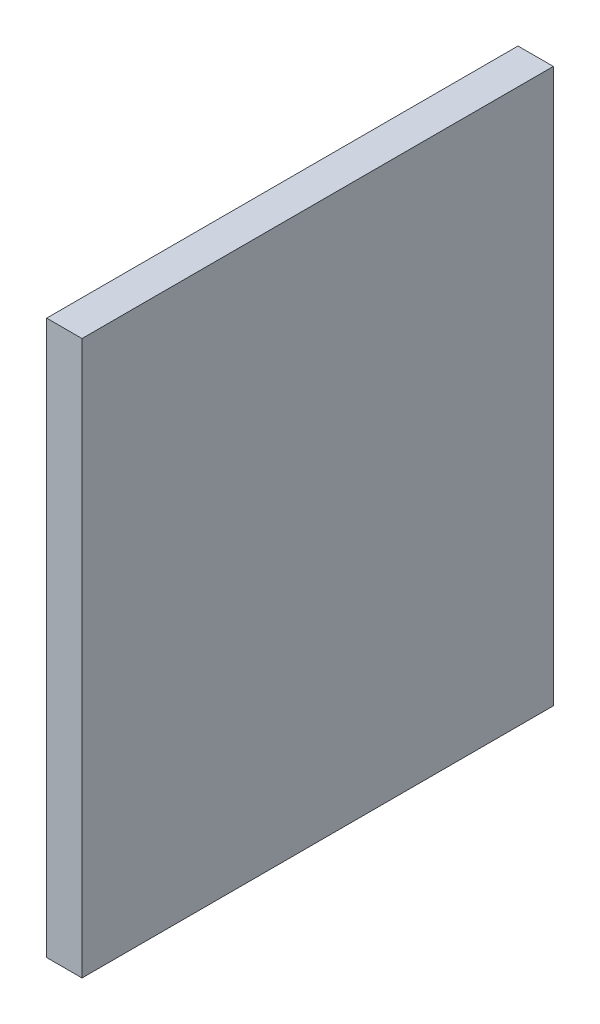
ISO-10303-21;
HEADER;
FILE_DESCRIPTION(('STEP AP214'),'2;1');
FILE_NAME('part.step','',(''),(''),'','','');
FILE_SCHEMA(('AUTOMOTIVE_DESIGN { 1 0 10303 214 1 1 1 1 }'));
ENDSEC;
DATA;
#1=APPLICATION_CONTEXT('core data for automotive mechanical design processes');
#2=APPLICATION_PROTOCOL_DEFINITION('international standard','automotive_design',2000,#1);
#3=PRODUCT_CONTEXT('',#1,'mechanical');
#4=PRODUCT('Part','Part','',(#3));
#5=PRODUCT_RELATED_PRODUCT_CATEGORY('part','',(#4));
#6=PRODUCT_DEFINITION_FORMATION('','',#4);
#7=PRODUCT_DEFINITION_CONTEXT('part definition',#1,'design');
#8=PRODUCT_DEFINITION('design','',#6,#7);
#9=PRODUCT_DEFINITION_SHAPE('','',#8);
#10=(LENGTH_UNIT() NAMED_UNIT(*) SI_UNIT(.MILLI.,.METRE.));
#11=(NAMED_UNIT(*) PLANE_ANGLE_UNIT() SI_UNIT($,.RADIAN.));
#12=(NAMED_UNIT(*) SI_UNIT($,.STERADIAN.) SOLID_ANGLE_UNIT());
#13=UNCERTAINTY_MEASURE_WITH_UNIT(LENGTH_MEASURE(1.E-05),#10,'distance_accuracy_value','');
#14=(GEOMETRIC_REPRESENTATION_CONTEXT(3) GLOBAL_UNCERTAINTY_ASSIGNED_CONTEXT((#13)) GLOBAL_UNIT_ASSIGNED_CONTEXT((#10,
#11,#12)) REPRESENTATION_CONTEXT('',''));
#15=CARTESIAN_POINT('',(0.,0.,0.));
#16=DIRECTION('',(0.,0.,1.));
#17=DIRECTION('',(1.,0.,0.));
#18=AXIS2_PLACEMENT_3D('',#15,#16,#17);
#19=CARTESIAN_POINT('',(64.6371308016878,-0.0100000000000031,7.15189873417722));
#20=DIRECTION('',(0.,0.,1.));
#21=DIRECTION('',(1.,0.,0.));
#22=AXIS2_PLACEMENT_3D('',#19,#20,#21);
#23=PLANE('',#22);
#24=DIRECTION('',(0.,1.,0.));
#25=VECTOR('',#24,1.);
#26=CARTESIAN_POINT('',(64.6371308016878,47.,7.15189873417722));
#27=LINE('',#26,#25);
#28=CARTESIAN_POINT('',(64.6371308016878,0.,7.15189873417722));
#29=VERTEX_POINT('',#28);
#30=CARTESIAN_POINT('',(64.6371308016878,47.,7.15189873417722));
#31=VERTEX_POINT('',#30);
#32=EDGE_CURVE('E49',#29,#31,#27,.T.);
#33=ORIENTED_EDGE('',*,*,#32,.F.);
#34=DIRECTION('',(1.,0.,0.));
#35=VECTOR('',#34,1.);
#36=CARTESIAN_POINT('',(0.,0.,7.15189873417722));
#37=LINE('',#36,#35);
#38=CARTESIAN_POINT('',(67.6371308016878,0.,7.15189873417722));
#39=VERTEX_POINT('',#38);
#40=EDGE_CURVE('E89',#29,#39,#37,.T.);
#41=ORIENTED_EDGE('',*,*,#40,.T.);
#42=DIRECTION('',(0.,1.,0.));
#43=VECTOR('',#42,1.);
#44=CARTESIAN_POINT('',(67.6371308016878,-0.0100000000000031,7.15189873417722));
#45=LINE('',#44,#43);
#46=CARTESIAN_POINT('',(67.6371308016878,47.,7.15189873417722));
#47=VERTEX_POINT('',#46);
#48=EDGE_CURVE('E76',#39,#47,#45,.T.);
#49=ORIENTED_EDGE('',*,*,#48,.T.);
#50=DIRECTION('',(1.,0.,0.));
#51=VECTOR('',#50,1.);
#52=CARTESIAN_POINT('',(0.,47.,7.15189873417722));
#53=LINE('',#52,#51);
#54=EDGE_CURVE('E84',#31,#47,#53,.T.);
#55=ORIENTED_EDGE('',*,*,#54,.F.);
#56=EDGE_LOOP('',(#33,#41,#49,#55));
#57=FACE_BOUND('',#56,.T.);
#58=ADVANCED_FACE('F32',(#57),#23,.T.);
#59=CARTESIAN_POINT('',(64.6371308016878,-0.0100000000000031,-32.8481012658228));
#60=DIRECTION('',(0.,0.,-1.));
#61=DIRECTION('',(-1.,0.,0.));
#62=AXIS2_PLACEMENT_3D('',#59,#60,#61);
#63=PLANE('',#62);
#64=DIRECTION('',(0.,-1.,0.));
#65=VECTOR('',#64,1.);
#66=CARTESIAN_POINT('',(67.6371308016878,50.,-32.8481012658228));
#67=LINE('',#66,#65);
#68=CARTESIAN_POINT('',(67.6371308016878,47.,-32.8481012658228));
#69=VERTEX_POINT('',#68);
#70=CARTESIAN_POINT('',(67.6371308016878,0.,-32.8481012658228));
#71=VERTEX_POINT('',#70);
#72=EDGE_CURVE('E36',#69,#71,#67,.T.);
#73=ORIENTED_EDGE('',*,*,#72,.T.);
#74=DIRECTION('',(-1.,0.,0.));
#75=VECTOR('',#74,1.);
#76=CARTESIAN_POINT('',(0.,0.,-32.8481012658228));
#77=LINE('',#76,#75);
#78=CARTESIAN_POINT('',(64.6371308016878,0.,-32.8481012658228));
#79=VERTEX_POINT('',#78);
#80=EDGE_CURVE('E90',#71,#79,#77,.T.);
#81=ORIENTED_EDGE('',*,*,#80,.T.);
#82=DIRECTION('',(0.,-1.,0.));
#83=VECTOR('',#82,1.);
#84=CARTESIAN_POINT('',(64.6371308016878,47.,-32.8481012658228));
#85=LINE('',#84,#83);
#86=CARTESIAN_POINT('',(64.6371308016878,47.,-32.8481012658228));
#87=VERTEX_POINT('',#86);
#88=EDGE_CURVE('E57',#87,#79,#85,.T.);
#89=ORIENTED_EDGE('',*,*,#88,.F.);
#90=DIRECTION('',(-1.,0.,0.));
#91=VECTOR('',#90,1.);
#92=CARTESIAN_POINT('',(0.,47.,-32.8481012658228));
#93=LINE('',#92,#91);
#94=EDGE_CURVE('E98',#69,#87,#93,.T.);
#95=ORIENTED_EDGE('',*,*,#94,.F.);
#96=EDGE_LOOP('',(#73,#81,#89,#95));
#97=FACE_BOUND('',#96,.T.);
#98=ADVANCED_FACE('F106',(#97),#63,.T.);
#99=CARTESIAN_POINT('',(64.6371308016878,47.,-47.8481012658228));
#100=DIRECTION('',(-1.,0.,0.));
#101=DIRECTION('',(0.,0.,1.));
#102=AXIS2_PLACEMENT_3D('',#99,#100,#101);
#103=PLANE('',#102);
#104=ORIENTED_EDGE('',*,*,#88,.T.);
#105=DIRECTION('',(0.,0.,1.));
#106=VECTOR('',#105,1.);
#107=CARTESIAN_POINT('',(64.6371308016878,0.,0.));
#108=LINE('',#107,#106);
#109=EDGE_CURVE('E92',#79,#29,#108,.T.);
#110=ORIENTED_EDGE('',*,*,#109,.T.);
#111=ORIENTED_EDGE('',*,*,#32,.T.);
#112=DIRECTION('',(0.,0.,-1.));
#113=VECTOR('',#112,1.);
#114=CARTESIAN_POINT('',(64.6371308016878,47.,-47.8481012658228));
#115=LINE('',#114,#113);
#116=EDGE_CURVE('E41',#31,#87,#115,.T.);
#117=ORIENTED_EDGE('',*,*,#116,.T.);
#118=EDGE_LOOP('',(#104,#110,#111,#117));
#119=FACE_BOUND('',#118,.T.);
#120=ADVANCED_FACE('F103',(#119),#103,.T.);
#121=CARTESIAN_POINT('',(0.,47.,0.));
#122=DIRECTION('',(0.,1.,0.));
#123=DIRECTION('',(0.,0.,1.));
#124=AXIS2_PLACEMENT_3D('',#121,#122,#123);
#125=PLANE('',#124);
#126=ORIENTED_EDGE('',*,*,#116,.F.);
#127=ORIENTED_EDGE('',*,*,#54,.T.);
#128=DIRECTION('',(0.,0.,-1.));
#129=VECTOR('',#128,1.);
#130=CARTESIAN_POINT('',(67.6371308016878,47.,-47.8481012658228));
#131=LINE('',#130,#129);
#132=EDGE_CURVE('E11',#47,#69,#131,.T.);
#133=ORIENTED_EDGE('',*,*,#132,.T.);
#134=ORIENTED_EDGE('',*,*,#94,.T.);
#135=EDGE_LOOP('',(#126,#127,#133,#134));
#136=FACE_BOUND('',#135,.T.);
#137=ADVANCED_FACE('F105',(#136),#125,.T.);
#138=CARTESIAN_POINT('',(67.6371308016878,50.,-47.8481012658228));
#139=DIRECTION('',(-1.,0.,0.));
#140=DIRECTION('',(0.,0.,1.));
#141=AXIS2_PLACEMENT_3D('',#138,#139,#140);
#142=PLANE('',#141);
#143=ORIENTED_EDGE('',*,*,#48,.F.);
#144=DIRECTION('',(0.,0.,-1.));
#145=VECTOR('',#144,1.);
#146=CARTESIAN_POINT('',(67.6371308016878,0.,-47.8481012658228));
#147=LINE('',#146,#145);
#148=EDGE_CURVE('E79',#39,#71,#147,.T.);
#149=ORIENTED_EDGE('',*,*,#148,.T.);
#150=ORIENTED_EDGE('',*,*,#72,.F.);
#151=ORIENTED_EDGE('',*,*,#132,.F.);
#152=EDGE_LOOP('',(#143,#149,#150,#151));
#153=FACE_BOUND('',#152,.T.);
#154=ADVANCED_FACE('F34',(#153),#142,.F.);
#155=CARTESIAN_POINT('',(0.,0.,0.));
#156=DIRECTION('',(0.,1.,0.));
#157=DIRECTION('',(0.,0.,1.));
#158=AXIS2_PLACEMENT_3D('',#155,#156,#157);
#159=PLANE('',#158);
#160=ORIENTED_EDGE('',*,*,#40,.F.);
#161=ORIENTED_EDGE('',*,*,#109,.F.);
#162=ORIENTED_EDGE('',*,*,#80,.F.);
#163=ORIENTED_EDGE('',*,*,#148,.F.);
#164=EDGE_LOOP('',(#160,#161,#162,#163));
#165=FACE_BOUND('',#164,.T.);
#166=ADVANCED_FACE('F87',(#165),#159,.F.);
#167=CLOSED_SHELL('',(#58,#98,#120,#137,#154,#166));
#168=MANIFOLD_SOLID_BREP('B2',#167);
#169=ADVANCED_BREP_SHAPE_REPRESENTATION('',(#18,#168),#14);
#170=SHAPE_DEFINITION_REPRESENTATION(#9,#169);
ENDSEC;
END-ISO-10303-21;
